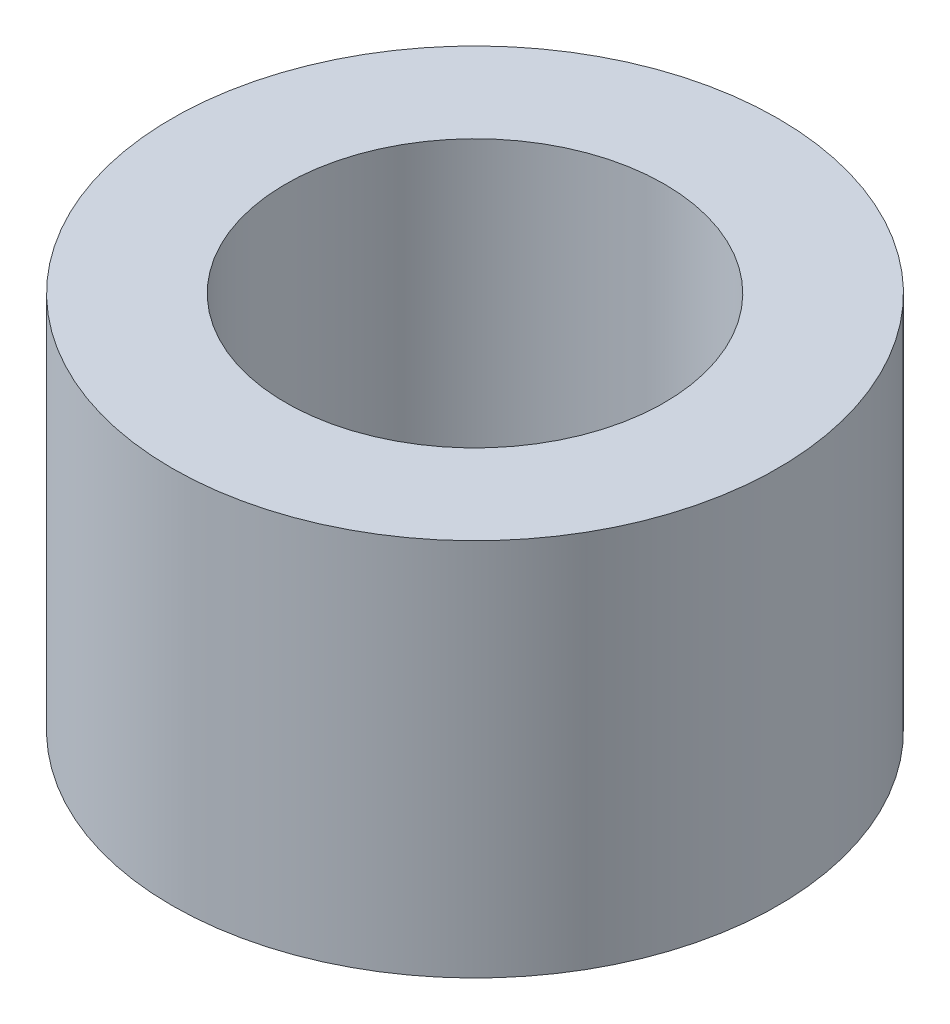
ISO-10303-21;
HEADER;
FILE_DESCRIPTION(('STEP AP214'),'2;1');
FILE_NAME('part.step','',(''),(''),'','','');
FILE_SCHEMA(('AUTOMOTIVE_DESIGN { 1 0 10303 214 1 1 1 1 }'));
ENDSEC;
DATA;
#1=APPLICATION_CONTEXT('core data for automotive mechanical design processes');
#2=APPLICATION_PROTOCOL_DEFINITION('international standard','automotive_design',2000,#1);
#3=PRODUCT_CONTEXT('',#1,'mechanical');
#4=PRODUCT('Part','Part','',(#3));
#5=PRODUCT_RELATED_PRODUCT_CATEGORY('part','',(#4));
#6=PRODUCT_DEFINITION_FORMATION('','',#4);
#7=PRODUCT_DEFINITION_CONTEXT('part definition',#1,'design');
#8=PRODUCT_DEFINITION('design','',#6,#7);
#9=PRODUCT_DEFINITION_SHAPE('','',#8);
#10=(LENGTH_UNIT() NAMED_UNIT(*) SI_UNIT(.MILLI.,.METRE.));
#11=(NAMED_UNIT(*) PLANE_ANGLE_UNIT() SI_UNIT($,.RADIAN.));
#12=(NAMED_UNIT(*) SI_UNIT($,.STERADIAN.) SOLID_ANGLE_UNIT());
#13=UNCERTAINTY_MEASURE_WITH_UNIT(LENGTH_MEASURE(1.E-05),#10,'distance_accuracy_value','');
#14=(GEOMETRIC_REPRESENTATION_CONTEXT(3) GLOBAL_UNCERTAINTY_ASSIGNED_CONTEXT((#13)) GLOBAL_UNIT_ASSIGNED_CONTEXT((#10,
#11,#12)) REPRESENTATION_CONTEXT('',''));
#15=CARTESIAN_POINT('',(0.,0.,0.));
#16=DIRECTION('',(0.,0.,1.));
#17=DIRECTION('',(1.,0.,0.));
#18=AXIS2_PLACEMENT_3D('',#15,#16,#17);
#19=CARTESIAN_POINT('',(0.,6.35,0.));
#20=DIRECTION('',(0.,-1.,0.));
#21=DIRECTION('',(0.,0.,-1.));
#22=AXIS2_PLACEMENT_3D('',#19,#20,#21);
#23=CYLINDRICAL_SURFACE('',#22,5.08);
#24=CARTESIAN_POINT('',(0.,6.35,0.));
#25=DIRECTION('',(0.,1.,0.));
#26=DIRECTION('',(0.,0.,1.));
#27=AXIS2_PLACEMENT_3D('',#24,#25,#26);
#28=CIRCLE('',#27,5.08);
#29=CARTESIAN_POINT('',(0.,6.35,5.08));
#30=VERTEX_POINT('',#29);
#31=EDGE_CURVE('E10',#30,#30,#28,.T.);
#32=ORIENTED_EDGE('',*,*,#31,.F.);
#33=EDGE_LOOP('',(#32));
#34=FACE_BOUND('',#33,.T.);
#35=CARTESIAN_POINT('',(0.,0.,0.));
#36=DIRECTION('',(0.,1.,0.));
#37=DIRECTION('',(0.,0.,1.));
#38=AXIS2_PLACEMENT_3D('',#35,#36,#37);
#39=CIRCLE('',#38,5.08);
#40=CARTESIAN_POINT('',(0.,0.,5.08));
#41=VERTEX_POINT('',#40);
#42=EDGE_CURVE('E40',#41,#41,#39,.T.);
#43=ORIENTED_EDGE('',*,*,#42,.T.);
#44=EDGE_LOOP('',(#43));
#45=FACE_BOUND('',#44,.T.);
#46=ADVANCED_FACE('F37',(#34,#45),#23,.T.);
#47=CARTESIAN_POINT('',(0.,6.35,0.));
#48=DIRECTION('',(0.,1.,0.));
#49=DIRECTION('',(0.,0.,1.));
#50=AXIS2_PLACEMENT_3D('',#47,#48,#49);
#51=PLANE('',#50);
#52=CARTESIAN_POINT('',(0.,6.35,0.));
#53=DIRECTION('',(0.,-1.,0.));
#54=DIRECTION('',(0.,0.,-1.));
#55=AXIS2_PLACEMENT_3D('',#52,#53,#54);
#56=CIRCLE('',#55,3.175);
#57=CARTESIAN_POINT('',(0.,6.35,-3.175));
#58=VERTEX_POINT('',#57);
#59=EDGE_CURVE('E49',#58,#58,#56,.T.);
#60=ORIENTED_EDGE('',*,*,#59,.T.);
#61=EDGE_LOOP('',(#60));
#62=FACE_BOUND('',#61,.T.);
#63=ORIENTED_EDGE('',*,*,#31,.T.);
#64=EDGE_LOOP('',(#63));
#65=FACE_BOUND('',#64,.T.);
#66=ADVANCED_FACE('F59',(#62,#65),#51,.T.);
#67=CARTESIAN_POINT('',(0.,0.,0.));
#68=DIRECTION('',(0.,1.,0.));
#69=DIRECTION('',(0.,0.,1.));
#70=AXIS2_PLACEMENT_3D('',#67,#68,#69);
#71=PLANE('',#70);
#72=CARTESIAN_POINT('',(0.,0.,0.));
#73=DIRECTION('',(0.,-1.,0.));
#74=DIRECTION('',(0.,0.,-1.));
#75=AXIS2_PLACEMENT_3D('',#72,#73,#74);
#76=CIRCLE('',#75,3.175);
#77=CARTESIAN_POINT('',(0.,0.,-3.175));
#78=VERTEX_POINT('',#77);
#79=EDGE_CURVE('E51',#78,#78,#76,.T.);
#80=ORIENTED_EDGE('',*,*,#79,.F.);
#81=EDGE_LOOP('',(#80));
#82=FACE_BOUND('',#81,.T.);
#83=ORIENTED_EDGE('',*,*,#42,.F.);
#84=EDGE_LOOP('',(#83));
#85=FACE_BOUND('',#84,.T.);
#86=ADVANCED_FACE('F64',(#82,#85),#71,.F.);
#87=CARTESIAN_POINT('',(0.,6.35,0.));
#88=DIRECTION('',(0.,-1.,0.));
#89=DIRECTION('',(0.,0.,-1.));
#90=AXIS2_PLACEMENT_3D('',#87,#88,#89);
#91=CYLINDRICAL_SURFACE('',#90,3.175);
#92=ORIENTED_EDGE('',*,*,#59,.F.);
#93=EDGE_LOOP('',(#92));
#94=FACE_BOUND('',#93,.T.);
#95=ORIENTED_EDGE('',*,*,#79,.T.);
#96=EDGE_LOOP('',(#95));
#97=FACE_BOUND('',#96,.T.);
#98=ADVANCED_FACE('F61',(#94,#97),#91,.F.);
#99=CLOSED_SHELL('',(#46,#66,#86,#98));
#100=MANIFOLD_SOLID_BREP('B2',#99);
#101=ADVANCED_BREP_SHAPE_REPRESENTATION('',(#18,#100),#14);
#102=SHAPE_DEFINITION_REPRESENTATION(#9,#101);
ENDSEC;
END-ISO-10303-21;
